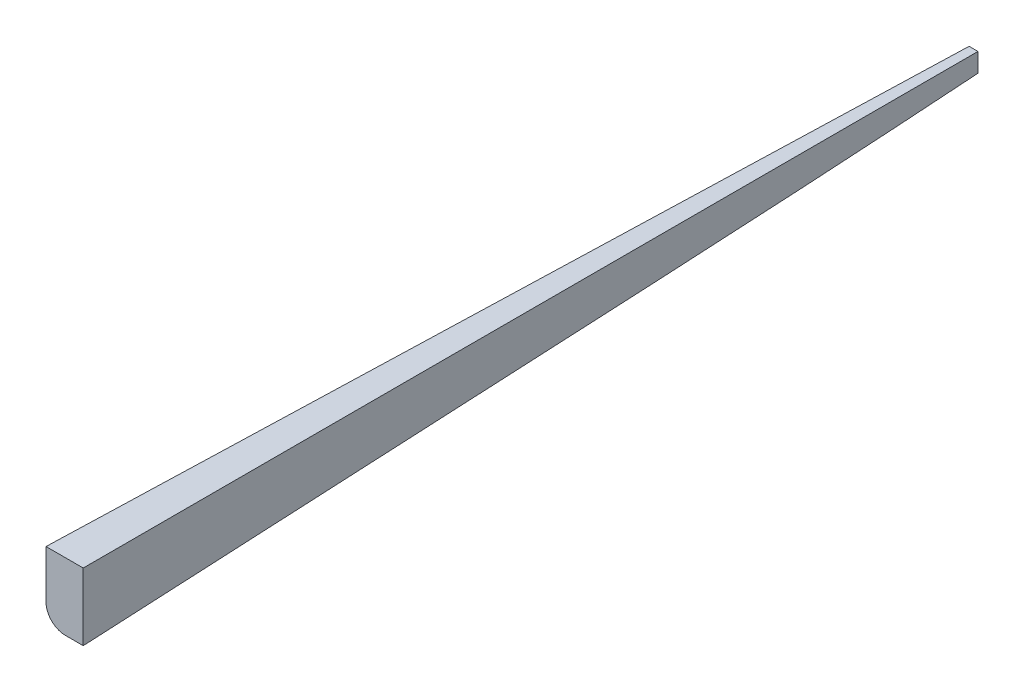
ISO-10303-21;
HEADER;
FILE_DESCRIPTION(('STEP AP214'),'2;1');
FILE_NAME('part.step','',(''),(''),'','','');
FILE_SCHEMA(('AUTOMOTIVE_DESIGN { 1 0 10303 214 1 1 1 1 }'));
ENDSEC;
DATA;
#1=APPLICATION_CONTEXT('core data for automotive mechanical design processes');
#2=APPLICATION_PROTOCOL_DEFINITION('international standard','automotive_design',2000,#1);
#3=PRODUCT_CONTEXT('',#1,'mechanical');
#4=PRODUCT('Part','Part','',(#3));
#5=PRODUCT_RELATED_PRODUCT_CATEGORY('part','',(#4));
#6=PRODUCT_DEFINITION_FORMATION('','',#4);
#7=PRODUCT_DEFINITION_CONTEXT('part definition',#1,'design');
#8=PRODUCT_DEFINITION('design','',#6,#7);
#9=PRODUCT_DEFINITION_SHAPE('','',#8);
#10=(LENGTH_UNIT() NAMED_UNIT(*) SI_UNIT(.MILLI.,.METRE.));
#11=(NAMED_UNIT(*) PLANE_ANGLE_UNIT() SI_UNIT($,.RADIAN.));
#12=(NAMED_UNIT(*) SI_UNIT($,.STERADIAN.) SOLID_ANGLE_UNIT());
#13=UNCERTAINTY_MEASURE_WITH_UNIT(LENGTH_MEASURE(1.E-05),#10,'distance_accuracy_value','');
#14=(GEOMETRIC_REPRESENTATION_CONTEXT(3) GLOBAL_UNCERTAINTY_ASSIGNED_CONTEXT((#13)) GLOBAL_UNIT_ASSIGNED_CONTEXT((#10,
#11,#12)) REPRESENTATION_CONTEXT('',''));
#15=CARTESIAN_POINT('',(0.,0.,0.));
#16=DIRECTION('',(0.,0.,1.));
#17=DIRECTION('',(1.,0.,0.));
#18=AXIS2_PLACEMENT_3D('',#15,#16,#17);
#19=CARTESIAN_POINT('',(0.,0.,-584.2));
#20=DIRECTION('',(0.,0.,1.));
#21=DIRECTION('',(1.,0.,0.));
#22=AXIS2_PLACEMENT_3D('',#19,#20,#21);
#23=PLANE('',#22);
#24=DIRECTION('',(0.,-1.,0.));
#25=VECTOR('',#24,1.);
#26=CARTESIAN_POINT('',(-18.161,0.,-584.2));
#27=LINE('',#26,#25);
#28=CARTESIAN_POINT('',(-18.161,5.96900000000002,-584.2));
#29=VERTEX_POINT('',#28);
#30=CARTESIAN_POINT('',(-18.161,-38.3259162166958,-584.2));
#31=VERTEX_POINT('',#30);
#32=EDGE_CURVE('E105',#29,#31,#27,.T.);
#33=ORIENTED_EDGE('',*,*,#32,.F.);
#34=DIRECTION('',(1.,0.,0.));
#35=VECTOR('',#34,1.);
#36=CARTESIAN_POINT('',(0.,5.96900000000002,-584.2));
#37=LINE('',#36,#35);
#38=CARTESIAN_POINT('',(-42.6703226354349,5.96900000000002,-584.2));
#39=VERTEX_POINT('',#38);
#40=EDGE_CURVE('E97',#39,#29,#37,.T.);
#41=ORIENTED_EDGE('',*,*,#40,.F.);
#42=DIRECTION('',(0.,-1.,0.));
#43=VECTOR('',#42,1.);
#44=CARTESIAN_POINT('',(-42.6703226354349,0.,-584.2));
#45=LINE('',#44,#43);
#46=CARTESIAN_POINT('',(-42.6703226354349,-25.6299972610752,-584.2));
#47=VERTEX_POINT('',#46);
#48=EDGE_CURVE('E102',#39,#47,#45,.T.);
#49=ORIENTED_EDGE('',*,*,#48,.T.);
#50=CARTESIAN_POINT('',(-29.9639479786131,-25.6096034762046,-584.2));
#51=DIRECTION('',(0.,0.,1.));
#52=DIRECTION('',(-0.52999894000318,-0.847998304005088,0.));
#53=AXIS2_PLACEMENT_3D('',#50,#51,#52);
#54=ELLIPSE('',#53,12.7226792238703,12.7);
#55=CARTESIAN_POINT('',(-29.9843258252833,-38.3259162166958,-584.2));
#56=VERTEX_POINT('',#55);
#57=EDGE_CURVE('E116',#56,#47,#54,.F.);
#58=ORIENTED_EDGE('',*,*,#57,.F.);
#59=DIRECTION('',(1.,0.,0.));
#60=VECTOR('',#59,1.);
#61=CARTESIAN_POINT('',(0.,-38.3259162166958,-584.2));
#62=LINE('',#61,#60);
#63=EDGE_CURVE('E106',#56,#31,#62,.T.);
#64=ORIENTED_EDGE('',*,*,#63,.T.);
#65=EDGE_LOOP('',(#33,#41,#49,#58,#64));
#66=FACE_BOUND('',#65,.T.);
#67=ADVANCED_FACE('F45',(#66),#23,.T.);
#68=CARTESIAN_POINT('',(0.,5.96900000000002,0.));
#69=DIRECTION('',(0.,1.,0.));
#70=DIRECTION('',(0.,0.,1.));
#71=AXIS2_PLACEMENT_3D('',#68,#69,#70);
#72=PLANE('',#71);
#73=DIRECTION('',(-0.0316721902279268,0.,0.999498310336824));
#74=VECTOR('',#73,1.);
#75=CARTESIAN_POINT('',(-61.1211296763861,5.96900000000002,-1.93681172447797));
#76=LINE('',#75,#74);
#77=CARTESIAN_POINT('',(-24.0069483527925,5.96900000000001,-1173.17130026192));
#78=VERTEX_POINT('',#77);
#79=EDGE_CURVE('E11',#78,#39,#76,.T.);
#80=ORIENTED_EDGE('',*,*,#79,.T.);
#81=ORIENTED_EDGE('',*,*,#40,.T.);
#82=DIRECTION('',(0.,0.,1.));
#83=VECTOR('',#82,1.);
#84=CARTESIAN_POINT('',(-18.161,5.96900000000002,0.));
#85=LINE('',#84,#83);
#86=CARTESIAN_POINT('',(-18.161,5.96900000000002,-1173.17130026192));
#87=VERTEX_POINT('',#86);
#88=EDGE_CURVE('E117',#87,#29,#85,.T.);
#89=ORIENTED_EDGE('',*,*,#88,.F.);
#90=DIRECTION('',(-1.,0.,0.));
#91=VECTOR('',#90,1.);
#92=CARTESIAN_POINT('',(0.,5.96900000000002,-1173.17130026192));
#93=LINE('',#92,#91);
#94=EDGE_CURVE('E54',#87,#78,#93,.T.);
#95=ORIENTED_EDGE('',*,*,#94,.T.);
#96=EDGE_LOOP('',(#80,#81,#89,#95));
#97=FACE_BOUND('',#96,.T.);
#98=ADVANCED_FACE('F96',(#97),#72,.T.);
#99=CARTESIAN_POINT('',(-18.161,0.,0.));
#100=DIRECTION('',(1.,0.,0.));
#101=DIRECTION('',(0.,0.,-1.));
#102=AXIS2_PLACEMENT_3D('',#99,#100,#101);
#103=PLANE('',#102);
#104=ORIENTED_EDGE('',*,*,#88,.T.);
#105=ORIENTED_EDGE('',*,*,#32,.T.);
#106=DIRECTION('',(0.,0.0506359003212277,-0.998717179985735));
#107=VECTOR('',#106,1.);
#108=CARTESIAN_POINT('',(-18.161,-67.7711940185204,-3.43606327571275));
#109=LINE('',#108,#107);
#110=CARTESIAN_POINT('',(-18.161,-19.4085948962424,-957.315787063962));
#111=VERTEX_POINT('',#110);
#112=EDGE_CURVE('E114',#31,#111,#109,.T.);
#113=ORIENTED_EDGE('',*,*,#112,.T.);
#114=CARTESIAN_POINT('',(-18.161,-6.72488671042359,-956.672711129882));
#115=DIRECTION('',(1.,0.,0.));
#116=DIRECTION('',(0.,-0.0506359003212277,0.998717179985735));
#117=AXIS2_PLACEMENT_3D('',#114,#115,#116);
#118=ELLIPSE('',#117,401.497221875209,12.7);
#119=CARTESIAN_POINT('',(-18.161,-6.46272974411311,-1173.17130026192));
#120=VERTEX_POINT('',#119);
#121=EDGE_CURVE('E124',#120,#111,#118,.F.);
#122=ORIENTED_EDGE('',*,*,#121,.F.);
#123=DIRECTION('',(0.,1.,0.));
#124=VECTOR('',#123,1.);
#125=CARTESIAN_POINT('',(-18.161,0.,-1173.17130026192));
#126=LINE('',#125,#124);
#127=EDGE_CURVE('E70',#120,#87,#126,.T.);
#128=ORIENTED_EDGE('',*,*,#127,.T.);
#129=EDGE_LOOP('',(#104,#105,#113,#122,#128));
#130=FACE_BOUND('',#129,.T.);
#131=ADVANCED_FACE('F130',(#130),#103,.T.);
#132=CARTESIAN_POINT('',(0.,0.,-1173.17130026192));
#133=DIRECTION('',(0.,0.,1.));
#134=DIRECTION('',(1.,0.,0.));
#135=AXIS2_PLACEMENT_3D('',#132,#133,#134);
#136=PLANE('',#135);
#137=ORIENTED_EDGE('',*,*,#94,.F.);
#138=ORIENTED_EDGE('',*,*,#127,.F.);
#139=CARTESIAN_POINT('',(-11.3005736959707,4.25179537602321,-1173.17130026192));
#140=DIRECTION('',(0.,0.,1.));
#141=DIRECTION('',(-0.52999894000318,-0.847998304005088,0.));
#142=AXIS2_PLACEMENT_3D('',#139,#140,#141);
#143=ELLIPSE('',#142,12.7226792238703,12.7);
#144=CARTESIAN_POINT('',(-24.0069483527925,4.23140159115264,-1173.17130026192));
#145=VERTEX_POINT('',#144);
#146=EDGE_CURVE('E127',#120,#145,#143,.F.);
#147=ORIENTED_EDGE('',*,*,#146,.T.);
#148=DIRECTION('',(0.,-1.,0.));
#149=VECTOR('',#148,1.);
#150=CARTESIAN_POINT('',(-24.0069483527925,0.,-1173.17130026192));
#151=LINE('',#150,#149);
#152=EDGE_CURVE('E62',#78,#145,#151,.T.);
#153=ORIENTED_EDGE('',*,*,#152,.F.);
#154=EDGE_LOOP('',(#137,#138,#147,#153));
#155=FACE_BOUND('',#154,.T.);
#156=ADVANCED_FACE('F140',(#155),#136,.F.);
#157=CARTESIAN_POINT('',(-61.1211296763861,0.,-1.93681172447797));
#158=DIRECTION('',(0.999498310336824,0.,0.0316721902279268));
#159=DIRECTION('',(0.0316721902279268,0.,-0.999498310336824));
#160=AXIS2_PLACEMENT_3D('',#157,#158,#159);
#161=PLANE('',#160);
#162=ORIENTED_EDGE('',*,*,#48,.F.);
#163=ORIENTED_EDGE('',*,*,#79,.F.);
#164=ORIENTED_EDGE('',*,*,#152,.T.);
#165=DIRECTION('',(-0.0316316011868878,-0.0506105618990205,0.998217417615331));
#166=VECTOR('',#165,1.);
#167=CARTESIAN_POINT('',(-61.0328383585854,-55.010022418116,-4.72307381510543));
#168=LINE('',#167,#166);
#169=EDGE_CURVE('E110',#145,#47,#168,.T.);
#170=ORIENTED_EDGE('',*,*,#169,.T.);
#171=EDGE_LOOP('',(#162,#163,#164,#170));
#172=FACE_BOUND('',#171,.T.);
#173=ADVANCED_FACE('F108',(#172),#161,.F.);
#174=CARTESIAN_POINT('',(0.,-67.7711940185204,-3.43606327571275));
#175=DIRECTION('',(0.,0.998717179985735,0.0506359003212277));
#176=DIRECTION('',(0.,-0.0506359003212277,0.998717179985735));
#177=AXIS2_PLACEMENT_3D('',#174,#175,#176);
#178=PLANE('',#177);
#179=ORIENTED_EDGE('',*,*,#63,.F.);
#180=DIRECTION('',(-0.0316316011868878,-0.0506105618990205,0.99821741761533));
#181=VECTOR('',#180,1.);
#182=CARTESIAN_POINT('',(-48.3392098173077,-67.6937306039349,-4.96391293329035));
#183=LINE('',#182,#181);
#184=EDGE_CURVE('E118',#56,#111,#183,.F.);
#185=ORIENTED_EDGE('',*,*,#184,.T.);
#186=ORIENTED_EDGE('',*,*,#112,.F.);
#187=EDGE_LOOP('',(#179,#185,#186));
#188=FACE_BOUND('',#187,.T.);
#189=ADVANCED_FACE('F136',(#188),#178,.F.);
#190=CARTESIAN_POINT('',(-48.3392098173077,-55.010022418116,-4.32083699921076));
#191=DIRECTION('',(-0.0316316011868878,-0.0506105618990205,0.99821741761533));
#192=DIRECTION('',(0.,-0.998717179985735,-0.0506359003212277));
#193=AXIS2_PLACEMENT_3D('',#190,#191,#192);
#194=CYLINDRICAL_SURFACE('',#193,12.7);
#195=ORIENTED_EDGE('',*,*,#184,.F.);
#196=ORIENTED_EDGE('',*,*,#57,.T.);
#197=ORIENTED_EDGE('',*,*,#169,.F.);
#198=ORIENTED_EDGE('',*,*,#146,.F.);
#199=ORIENTED_EDGE('',*,*,#121,.T.);
#200=EDGE_LOOP('',(#195,#196,#197,#198,#199));
#201=FACE_BOUND('',#200,.T.);
#202=ADVANCED_FACE('F47',(#201),#194,.T.);
#203=CLOSED_SHELL('',(#67,#98,#131,#156,#173,#189,#202));
#204=MANIFOLD_SOLID_BREP('B2',#203);
#205=ADVANCED_BREP_SHAPE_REPRESENTATION('',(#18,#204),#14);
#206=SHAPE_DEFINITION_REPRESENTATION(#9,#205);
ENDSEC;
END-ISO-10303-21;
